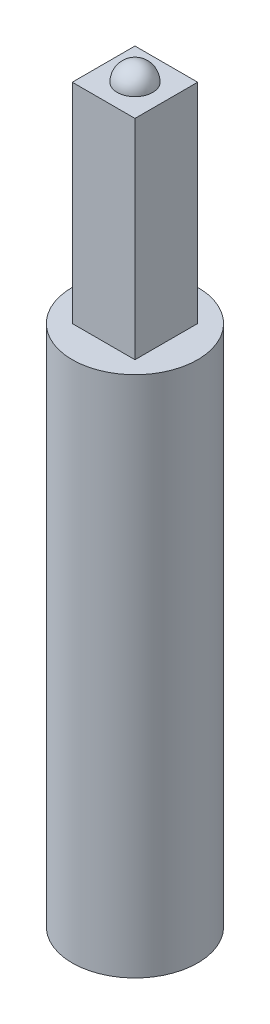
ISO-10303-21;
HEADER;
FILE_DESCRIPTION(('STEP AP214'),'2;1');
FILE_NAME('part.step','',(''),(''),'','','');
FILE_SCHEMA(('AUTOMOTIVE_DESIGN { 1 0 10303 214 1 1 1 1 }'));
ENDSEC;
DATA;
#1=APPLICATION_CONTEXT('core data for automotive mechanical design processes');
#2=APPLICATION_PROTOCOL_DEFINITION('international standard','automotive_design',2000,#1);
#3=PRODUCT_CONTEXT('',#1,'mechanical');
#4=PRODUCT('Part','Part','',(#3));
#5=PRODUCT_RELATED_PRODUCT_CATEGORY('part','',(#4));
#6=PRODUCT_DEFINITION_FORMATION('','',#4);
#7=PRODUCT_DEFINITION_CONTEXT('part definition',#1,'design');
#8=PRODUCT_DEFINITION('design','',#6,#7);
#9=PRODUCT_DEFINITION_SHAPE('','',#8);
#10=(LENGTH_UNIT() NAMED_UNIT(*) SI_UNIT(.MILLI.,.METRE.));
#11=(NAMED_UNIT(*) PLANE_ANGLE_UNIT() SI_UNIT($,.RADIAN.));
#12=(NAMED_UNIT(*) SI_UNIT($,.STERADIAN.) SOLID_ANGLE_UNIT());
#13=UNCERTAINTY_MEASURE_WITH_UNIT(LENGTH_MEASURE(1.E-05),#10,'distance_accuracy_value','');
#14=(GEOMETRIC_REPRESENTATION_CONTEXT(3) GLOBAL_UNCERTAINTY_ASSIGNED_CONTEXT((#13)) GLOBAL_UNIT_ASSIGNED_CONTEXT((#10,
#11,#12)) REPRESENTATION_CONTEXT('',''));
#15=CARTESIAN_POINT('',(0.,0.,0.));
#16=DIRECTION('',(0.,0.,1.));
#17=DIRECTION('',(1.,0.,0.));
#18=AXIS2_PLACEMENT_3D('',#15,#16,#17);
#19=CARTESIAN_POINT('',(0.,250.,0.));
#20=DIRECTION('',(0.,-1.,0.));
#21=DIRECTION('',(0.,0.,-1.));
#22=AXIS2_PLACEMENT_3D('',#19,#20,#21);
#23=CYLINDRICAL_SURFACE('',#22,30.);
#24=CARTESIAN_POINT('',(0.,250.,0.));
#25=DIRECTION('',(0.,1.,0.));
#26=DIRECTION('',(0.,0.,1.));
#27=AXIS2_PLACEMENT_3D('',#24,#25,#26);
#28=CIRCLE('',#27,30.);
#29=CARTESIAN_POINT('',(0.,250.,30.));
#30=VERTEX_POINT('',#29);
#31=EDGE_CURVE('E48',#30,#30,#28,.T.);
#32=ORIENTED_EDGE('',*,*,#31,.F.);
#33=EDGE_LOOP('',(#32));
#34=FACE_BOUND('',#33,.T.);
#35=CARTESIAN_POINT('',(0.,0.,0.));
#36=DIRECTION('',(0.,1.,0.));
#37=DIRECTION('',(0.,0.,1.));
#38=AXIS2_PLACEMENT_3D('',#35,#36,#37);
#39=CIRCLE('',#38,30.);
#40=CARTESIAN_POINT('',(0.,0.,30.));
#41=VERTEX_POINT('',#40);
#42=EDGE_CURVE('E103',#41,#41,#39,.T.);
#43=ORIENTED_EDGE('',*,*,#42,.T.);
#44=EDGE_LOOP('',(#43));
#45=FACE_BOUND('',#44,.T.);
#46=ADVANCED_FACE('F40',(#34,#45),#23,.T.);
#47=CARTESIAN_POINT('',(0.,250.,0.));
#48=DIRECTION('',(0.,1.,0.));
#49=DIRECTION('',(0.,0.,1.));
#50=AXIS2_PLACEMENT_3D('',#47,#48,#49);
#51=PLANE('',#50);
#52=DIRECTION('',(1.,0.,0.));
#53=VECTOR('',#52,1.);
#54=CARTESIAN_POINT('',(15.,250.,15.));
#55=LINE('',#54,#53);
#56=CARTESIAN_POINT('',(-15.,250.,15.));
#57=VERTEX_POINT('',#56);
#58=CARTESIAN_POINT('',(15.,250.,15.));
#59=VERTEX_POINT('',#58);
#60=EDGE_CURVE('E55',#57,#59,#55,.T.);
#61=ORIENTED_EDGE('',*,*,#60,.F.);
#62=DIRECTION('',(0.,0.,1.));
#63=VECTOR('',#62,1.);
#64=CARTESIAN_POINT('',(-15.,250.,-0.769018565524844));
#65=LINE('',#64,#63);
#66=CARTESIAN_POINT('',(-15.,250.,-15.));
#67=VERTEX_POINT('',#66);
#68=EDGE_CURVE('E59',#67,#57,#65,.T.);
#69=ORIENTED_EDGE('',*,*,#68,.F.);
#70=DIRECTION('',(-1.,0.,0.));
#71=VECTOR('',#70,1.);
#72=CARTESIAN_POINT('',(-15.,250.,-15.));
#73=LINE('',#72,#71);
#74=CARTESIAN_POINT('',(15.,250.,-15.));
#75=VERTEX_POINT('',#74);
#76=EDGE_CURVE('E204',#75,#67,#73,.T.);
#77=ORIENTED_EDGE('',*,*,#76,.F.);
#78=DIRECTION('',(0.,0.,-1.));
#79=VECTOR('',#78,1.);
#80=CARTESIAN_POINT('',(15.,250.,-15.));
#81=LINE('',#80,#79);
#82=EDGE_CURVE('E209',#59,#75,#81,.T.);
#83=ORIENTED_EDGE('',*,*,#82,.F.);
#84=EDGE_LOOP('',(#61,#69,#77,#83));
#85=FACE_BOUND('',#84,.T.);
#86=ORIENTED_EDGE('',*,*,#31,.T.);
#87=EDGE_LOOP('',(#86));
#88=FACE_BOUND('',#87,.T.);
#89=ADVANCED_FACE('F116',(#85,#88),#51,.T.);
#90=CARTESIAN_POINT('',(0.,0.,0.));
#91=DIRECTION('',(0.,1.,0.));
#92=DIRECTION('',(0.,0.,1.));
#93=AXIS2_PLACEMENT_3D('',#90,#91,#92);
#94=PLANE('',#93);
#95=ORIENTED_EDGE('',*,*,#42,.F.);
#96=EDGE_LOOP('',(#95));
#97=FACE_BOUND('',#96,.T.);
#98=ADVANCED_FACE('F122',(#97),#94,.F.);
#99=CARTESIAN_POINT('',(15.,350.,15.));
#100=DIRECTION('',(0.,0.,-1.));
#101=DIRECTION('',(-1.,0.,0.));
#102=AXIS2_PLACEMENT_3D('',#99,#100,#101);
#103=PLANE('',#102);
#104=ORIENTED_EDGE('',*,*,#60,.T.);
#105=DIRECTION('',(0.,-1.,0.));
#106=VECTOR('',#105,1.);
#107=CARTESIAN_POINT('',(15.,350.,15.));
#108=LINE('',#107,#106);
#109=CARTESIAN_POINT('',(15.,350.,15.));
#110=VERTEX_POINT('',#109);
#111=EDGE_CURVE('E85',#110,#59,#108,.T.);
#112=ORIENTED_EDGE('',*,*,#111,.F.);
#113=DIRECTION('',(1.,0.,0.));
#114=VECTOR('',#113,1.);
#115=CARTESIAN_POINT('',(15.,350.,15.));
#116=LINE('',#115,#114);
#117=CARTESIAN_POINT('',(-15.,350.,15.));
#118=VERTEX_POINT('',#117);
#119=EDGE_CURVE('E79',#118,#110,#116,.T.);
#120=ORIENTED_EDGE('',*,*,#119,.F.);
#121=DIRECTION('',(0.,-1.,0.));
#122=VECTOR('',#121,1.);
#123=CARTESIAN_POINT('',(-15.,350.,15.));
#124=LINE('',#123,#122);
#125=EDGE_CURVE('E83',#118,#57,#124,.T.);
#126=ORIENTED_EDGE('',*,*,#125,.T.);
#127=EDGE_LOOP('',(#104,#112,#120,#126));
#128=FACE_BOUND('',#127,.T.);
#129=ADVANCED_FACE('F81',(#128),#103,.F.);
#130=CARTESIAN_POINT('',(15.,350.,-15.));
#131=DIRECTION('',(-1.,0.,0.));
#132=DIRECTION('',(0.,0.,1.));
#133=AXIS2_PLACEMENT_3D('',#130,#131,#132);
#134=PLANE('',#133);
#135=ORIENTED_EDGE('',*,*,#82,.T.);
#136=DIRECTION('',(0.,-1.,0.));
#137=VECTOR('',#136,1.);
#138=CARTESIAN_POINT('',(15.,350.,-15.));
#139=LINE('',#138,#137);
#140=CARTESIAN_POINT('',(15.,350.,-15.));
#141=VERTEX_POINT('',#140);
#142=EDGE_CURVE('E108',#141,#75,#139,.T.);
#143=ORIENTED_EDGE('',*,*,#142,.F.);
#144=DIRECTION('',(0.,0.,-1.));
#145=VECTOR('',#144,1.);
#146=CARTESIAN_POINT('',(15.,350.,-15.));
#147=LINE('',#146,#145);
#148=EDGE_CURVE('E89',#110,#141,#147,.T.);
#149=ORIENTED_EDGE('',*,*,#148,.F.);
#150=ORIENTED_EDGE('',*,*,#111,.T.);
#151=EDGE_LOOP('',(#135,#143,#149,#150));
#152=FACE_BOUND('',#151,.T.);
#153=ADVANCED_FACE('F128',(#152),#134,.F.);
#154=CARTESIAN_POINT('',(-15.,350.,-15.));
#155=DIRECTION('',(0.,0.,1.));
#156=DIRECTION('',(1.,0.,0.));
#157=AXIS2_PLACEMENT_3D('',#154,#155,#156);
#158=PLANE('',#157);
#159=ORIENTED_EDGE('',*,*,#76,.T.);
#160=DIRECTION('',(0.,-1.,0.));
#161=VECTOR('',#160,1.);
#162=CARTESIAN_POINT('',(-15.,350.,-15.));
#163=LINE('',#162,#161);
#164=CARTESIAN_POINT('',(-15.,350.,-15.));
#165=VERTEX_POINT('',#164);
#166=EDGE_CURVE('E205',#165,#67,#163,.T.);
#167=ORIENTED_EDGE('',*,*,#166,.F.);
#168=DIRECTION('',(-1.,0.,0.));
#169=VECTOR('',#168,1.);
#170=CARTESIAN_POINT('',(-15.,350.,-15.));
#171=LINE('',#170,#169);
#172=EDGE_CURVE('E95',#141,#165,#171,.T.);
#173=ORIENTED_EDGE('',*,*,#172,.F.);
#174=ORIENTED_EDGE('',*,*,#142,.T.);
#175=EDGE_LOOP('',(#159,#167,#173,#174));
#176=FACE_BOUND('',#175,.T.);
#177=ADVANCED_FACE('F134',(#176),#158,.F.);
#178=CARTESIAN_POINT('',(-15.,350.,-0.769018565524844));
#179=DIRECTION('',(1.,0.,0.));
#180=DIRECTION('',(0.,0.,-1.));
#181=AXIS2_PLACEMENT_3D('',#178,#179,#180);
#182=PLANE('',#181);
#183=ORIENTED_EDGE('',*,*,#68,.T.);
#184=ORIENTED_EDGE('',*,*,#125,.F.);
#185=DIRECTION('',(0.,0.,1.));
#186=VECTOR('',#185,1.);
#187=CARTESIAN_POINT('',(-15.,350.,15.));
#188=LINE('',#187,#186);
#189=EDGE_CURVE('E90',#165,#118,#188,.T.);
#190=ORIENTED_EDGE('',*,*,#189,.F.);
#191=ORIENTED_EDGE('',*,*,#166,.T.);
#192=EDGE_LOOP('',(#183,#184,#190,#191));
#193=FACE_BOUND('',#192,.T.);
#194=ADVANCED_FACE('F101',(#193),#182,.F.);
#195=CARTESIAN_POINT('',(0.,350.,0.));
#196=DIRECTION('',(0.,-1.,0.));
#197=DIRECTION('',(0.,0.,-1.));
#198=AXIS2_PLACEMENT_3D('',#195,#196,#197);
#199=PLANE('',#198);
#200=CARTESIAN_POINT('',(0.,350.,0.));
#201=DIRECTION('',(0.,-1.,0.));
#202=DIRECTION('',(0.,0.,-1.));
#203=AXIS2_PLACEMENT_3D('',#200,#201,#202);
#204=CIRCLE('',#203,8.5);
#205=CARTESIAN_POINT('',(0.,350.,-8.5));
#206=VERTEX_POINT('',#205);
#207=EDGE_CURVE('E11',#206,#206,#204,.F.);
#208=ORIENTED_EDGE('',*,*,#207,.F.);
#209=EDGE_LOOP('',(#208));
#210=FACE_BOUND('',#209,.T.);
#211=ORIENTED_EDGE('',*,*,#189,.T.);
#212=ORIENTED_EDGE('',*,*,#119,.T.);
#213=ORIENTED_EDGE('',*,*,#148,.T.);
#214=ORIENTED_EDGE('',*,*,#172,.T.);
#215=EDGE_LOOP('',(#211,#212,#213,#214));
#216=FACE_BOUND('',#215,.T.);
#217=ADVANCED_FACE('F93',(#210,#216),#199,.F.);
#218=CARTESIAN_POINT('',(0.,350.,0.));
#219=DIRECTION('',(0.,0.,-1.));
#220=DIRECTION('',(-1.,0.,0.));
#221=AXIS2_PLACEMENT_3D('',#218,#219,#220);
#222=SPHERICAL_SURFACE('',#221,8.5);
#223=CARTESIAN_POINT('',(0.,350.,0.));
#224=DIRECTION('',(0.,-1.,0.));
#225=DIRECTION('',(0.,0.,-1.));
#226=AXIS2_PLACEMENT_3D('',#223,#224,#225);
#227=SPHERICAL_SURFACE('',#226,8.5);
#228=ORIENTED_EDGE('',*,*,#207,.T.);
#229=EDGE_LOOP('',(#228));
#230=FACE_BOUND('',#229,.T.);
#231=ADVANCED_FACE('F143',(#230),#227,.T.);
#232=CLOSED_SHELL('',(#46,#89,#98,#129,#153,#177,#194,#217,#231));
#233=MANIFOLD_SOLID_BREP('B2',#232);
#234=ADVANCED_BREP_SHAPE_REPRESENTATION('',(#18,#233),#14);
#235=SHAPE_DEFINITION_REPRESENTATION(#9,#234);
ENDSEC;
END-ISO-10303-21;
